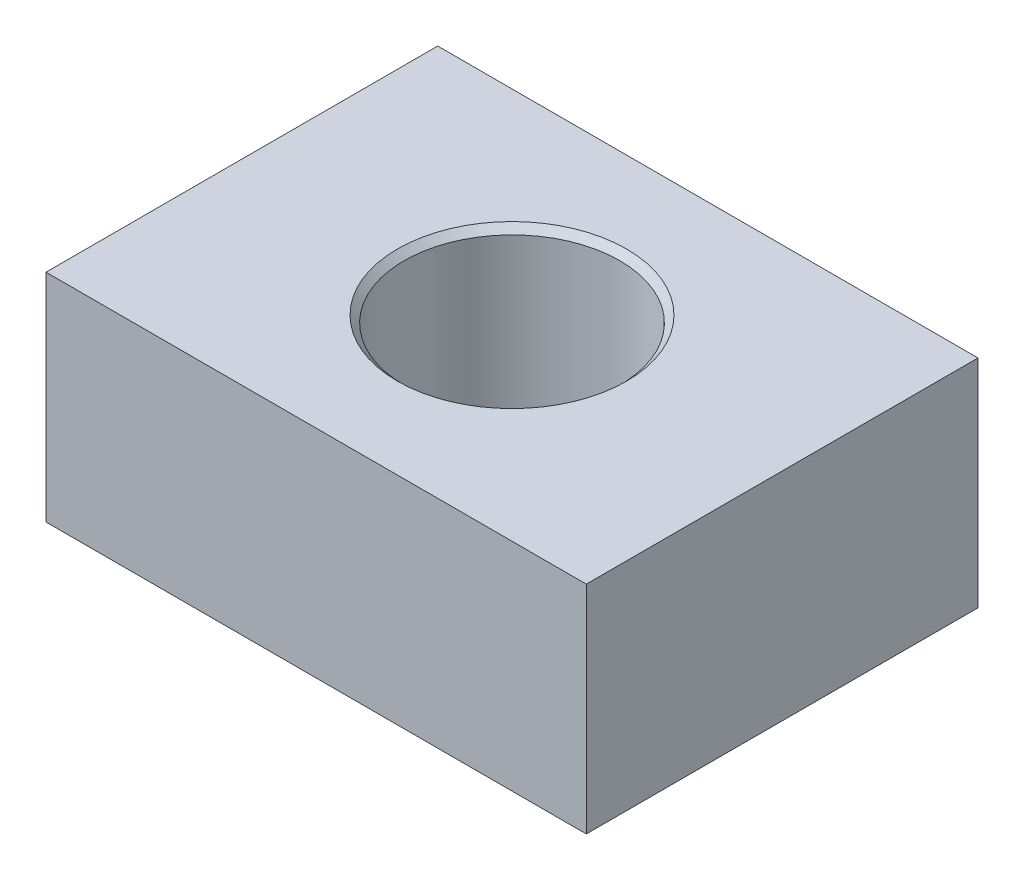
ISO-10303-21;
HEADER;
FILE_DESCRIPTION(('STEP AP214'),'2;1');
FILE_NAME('part.step','',(''),(''),'','','');
FILE_SCHEMA(('AUTOMOTIVE_DESIGN { 1 0 10303 214 1 1 1 1 }'));
ENDSEC;
DATA;
#1=APPLICATION_CONTEXT('core data for automotive mechanical design processes');
#2=APPLICATION_PROTOCOL_DEFINITION('international standard','automotive_design',2000,#1);
#3=PRODUCT_CONTEXT('',#1,'mechanical');
#4=PRODUCT('Part','Part','',(#3));
#5=PRODUCT_RELATED_PRODUCT_CATEGORY('part','',(#4));
#6=PRODUCT_DEFINITION_FORMATION('','',#4);
#7=PRODUCT_DEFINITION_CONTEXT('part definition',#1,'design');
#8=PRODUCT_DEFINITION('design','',#6,#7);
#9=PRODUCT_DEFINITION_SHAPE('','',#8);
#10=(LENGTH_UNIT() NAMED_UNIT(*) SI_UNIT(.MILLI.,.METRE.));
#11=(NAMED_UNIT(*) PLANE_ANGLE_UNIT() SI_UNIT($,.RADIAN.));
#12=(NAMED_UNIT(*) SI_UNIT($,.STERADIAN.) SOLID_ANGLE_UNIT());
#13=UNCERTAINTY_MEASURE_WITH_UNIT(LENGTH_MEASURE(1.E-05),#10,'distance_accuracy_value','');
#14=(GEOMETRIC_REPRESENTATION_CONTEXT(3) GLOBAL_UNCERTAINTY_ASSIGNED_CONTEXT((#13)) GLOBAL_UNIT_ASSIGNED_CONTEXT((#10,
#11,#12)) REPRESENTATION_CONTEXT('',''));
#15=CARTESIAN_POINT('',(0.,0.,0.));
#16=DIRECTION('',(0.,0.,1.));
#17=DIRECTION('',(1.,0.,0.));
#18=AXIS2_PLACEMENT_3D('',#15,#16,#17);
#19=CARTESIAN_POINT('',(10.,8.01,-7.25));
#20=DIRECTION('',(0.,-1.,0.));
#21=DIRECTION('',(0.,0.,-1.));
#22=AXIS2_PLACEMENT_3D('',#19,#20,#21);
#23=PLANE('',#22);
#24=CARTESIAN_POINT('',(0.,8.01,0.));
#25=DIRECTION('',(0.,-1.,0.));
#26=DIRECTION('',(0.,0.,-1.));
#27=AXIS2_PLACEMENT_3D('',#24,#25,#26);
#28=CIRCLE('',#27,4.24);
#29=CARTESIAN_POINT('',(0.,8.01,-4.24));
#30=VERTEX_POINT('',#29);
#31=EDGE_CURVE('E40',#30,#30,#28,.T.);
#32=ORIENTED_EDGE('',*,*,#31,.T.);
#33=EDGE_LOOP('',(#32));
#34=FACE_BOUND('',#33,.T.);
#35=DIRECTION('',(0.,0.,-1.));
#36=VECTOR('',#35,1.);
#37=CARTESIAN_POINT('',(10.,8.01,7.25));
#38=LINE('',#37,#36);
#39=CARTESIAN_POINT('',(10.,8.01,7.25));
#40=VERTEX_POINT('',#39);
#41=CARTESIAN_POINT('',(10.,8.01,-7.25));
#42=VERTEX_POINT('',#41);
#43=EDGE_CURVE('E83',#40,#42,#38,.T.);
#44=ORIENTED_EDGE('',*,*,#43,.T.);
#45=DIRECTION('',(-1.,0.,0.));
#46=VECTOR('',#45,1.);
#47=CARTESIAN_POINT('',(-10.,8.01,-7.25));
#48=LINE('',#47,#46);
#49=CARTESIAN_POINT('',(-10.,8.01,-7.25));
#50=VERTEX_POINT('',#49);
#51=EDGE_CURVE('E79',#42,#50,#48,.T.);
#52=ORIENTED_EDGE('',*,*,#51,.T.);
#53=DIRECTION('',(0.,0.,1.));
#54=VECTOR('',#53,1.);
#55=CARTESIAN_POINT('',(-10.,8.01,7.25));
#56=LINE('',#55,#54);
#57=CARTESIAN_POINT('',(-10.,8.01,7.25));
#58=VERTEX_POINT('',#57);
#59=EDGE_CURVE('E81',#50,#58,#56,.T.);
#60=ORIENTED_EDGE('',*,*,#59,.T.);
#61=DIRECTION('',(1.,0.,0.));
#62=VECTOR('',#61,1.);
#63=CARTESIAN_POINT('',(-10.,8.01,7.25));
#64=LINE('',#63,#62);
#65=EDGE_CURVE('E48',#58,#40,#64,.T.);
#66=ORIENTED_EDGE('',*,*,#65,.T.);
#67=EDGE_LOOP('',(#44,#52,#60,#66));
#68=FACE_BOUND('',#67,.T.);
#69=ADVANCED_FACE('F31',(#34,#68),#23,.F.);
#70=CARTESIAN_POINT('',(10.,0.,-7.25));
#71=DIRECTION('',(0.,-1.,0.));
#72=DIRECTION('',(0.,0.,-1.));
#73=AXIS2_PLACEMENT_3D('',#70,#71,#72);
#74=PLANE('',#73);
#75=CARTESIAN_POINT('',(0.,0.,0.));
#76=DIRECTION('',(0.,-1.,0.));
#77=DIRECTION('',(0.,0.,-1.));
#78=AXIS2_PLACEMENT_3D('',#75,#76,#77);
#79=CIRCLE('',#78,4.24);
#80=CARTESIAN_POINT('',(0.,0.,-4.24));
#81=VERTEX_POINT('',#80);
#82=EDGE_CURVE('E11',#81,#81,#79,.F.);
#83=ORIENTED_EDGE('',*,*,#82,.T.);
#84=EDGE_LOOP('',(#83));
#85=FACE_BOUND('',#84,.T.);
#86=DIRECTION('',(0.,0.,-1.));
#87=VECTOR('',#86,1.);
#88=CARTESIAN_POINT('',(10.,0.,7.25));
#89=LINE('',#88,#87);
#90=CARTESIAN_POINT('',(10.,0.,7.25));
#91=VERTEX_POINT('',#90);
#92=CARTESIAN_POINT('',(10.,0.,-7.25));
#93=VERTEX_POINT('',#92);
#94=EDGE_CURVE('E98',#91,#93,#89,.T.);
#95=ORIENTED_EDGE('',*,*,#94,.F.);
#96=DIRECTION('',(1.,0.,0.));
#97=VECTOR('',#96,1.);
#98=CARTESIAN_POINT('',(-10.,0.,7.25));
#99=LINE('',#98,#97);
#100=CARTESIAN_POINT('',(-10.,0.,7.25));
#101=VERTEX_POINT('',#100);
#102=EDGE_CURVE('E71',#101,#91,#99,.T.);
#103=ORIENTED_EDGE('',*,*,#102,.F.);
#104=DIRECTION('',(0.,0.,1.));
#105=VECTOR('',#104,1.);
#106=CARTESIAN_POINT('',(-10.,0.,7.25));
#107=LINE('',#106,#105);
#108=CARTESIAN_POINT('',(-10.,0.,-7.25));
#109=VERTEX_POINT('',#108);
#110=EDGE_CURVE('E65',#109,#101,#107,.T.);
#111=ORIENTED_EDGE('',*,*,#110,.F.);
#112=DIRECTION('',(-1.,0.,0.));
#113=VECTOR('',#112,1.);
#114=CARTESIAN_POINT('',(-10.,0.,-7.25));
#115=LINE('',#114,#113);
#116=EDGE_CURVE('E88',#93,#109,#115,.T.);
#117=ORIENTED_EDGE('',*,*,#116,.F.);
#118=EDGE_LOOP('',(#95,#103,#111,#117));
#119=FACE_BOUND('',#118,.T.);
#120=ADVANCED_FACE('F132',(#85,#119),#74,.T.);
#121=CARTESIAN_POINT('',(10.,8.01,7.25));
#122=DIRECTION('',(-1.,0.,0.));
#123=DIRECTION('',(0.,0.,1.));
#124=AXIS2_PLACEMENT_3D('',#121,#122,#123);
#125=PLANE('',#124);
#126=ORIENTED_EDGE('',*,*,#94,.T.);
#127=DIRECTION('',(0.,-1.,0.));
#128=VECTOR('',#127,1.);
#129=CARTESIAN_POINT('',(10.,8.01,-7.25));
#130=LINE('',#129,#128);
#131=EDGE_CURVE('E89',#42,#93,#130,.T.);
#132=ORIENTED_EDGE('',*,*,#131,.F.);
#133=ORIENTED_EDGE('',*,*,#43,.F.);
#134=DIRECTION('',(0.,-1.,0.));
#135=VECTOR('',#134,1.);
#136=CARTESIAN_POINT('',(10.,8.01,7.25));
#137=LINE('',#136,#135);
#138=EDGE_CURVE('E94',#40,#91,#137,.T.);
#139=ORIENTED_EDGE('',*,*,#138,.T.);
#140=EDGE_LOOP('',(#126,#132,#133,#139));
#141=FACE_BOUND('',#140,.T.);
#142=ADVANCED_FACE('F135',(#141),#125,.F.);
#143=CARTESIAN_POINT('',(-10.,8.01,-7.25));
#144=DIRECTION('',(0.,0.,1.));
#145=DIRECTION('',(1.,0.,0.));
#146=AXIS2_PLACEMENT_3D('',#143,#144,#145);
#147=PLANE('',#146);
#148=ORIENTED_EDGE('',*,*,#116,.T.);
#149=DIRECTION('',(0.,-1.,0.));
#150=VECTOR('',#149,1.);
#151=CARTESIAN_POINT('',(-10.,8.01,-7.25));
#152=LINE('',#151,#150);
#153=EDGE_CURVE('E86',#50,#109,#152,.T.);
#154=ORIENTED_EDGE('',*,*,#153,.F.);
#155=ORIENTED_EDGE('',*,*,#51,.F.);
#156=ORIENTED_EDGE('',*,*,#131,.T.);
#157=EDGE_LOOP('',(#148,#154,#155,#156));
#158=FACE_BOUND('',#157,.T.);
#159=ADVANCED_FACE('F87',(#158),#147,.F.);
#160=CARTESIAN_POINT('',(-10.,8.01,7.25));
#161=DIRECTION('',(1.,0.,0.));
#162=DIRECTION('',(0.,0.,-1.));
#163=AXIS2_PLACEMENT_3D('',#160,#161,#162);
#164=PLANE('',#163);
#165=ORIENTED_EDGE('',*,*,#110,.T.);
#166=DIRECTION('',(0.,-1.,0.));
#167=VECTOR('',#166,1.);
#168=CARTESIAN_POINT('',(-10.,8.01,7.25));
#169=LINE('',#168,#167);
#170=EDGE_CURVE('E90',#58,#101,#169,.T.);
#171=ORIENTED_EDGE('',*,*,#170,.F.);
#172=ORIENTED_EDGE('',*,*,#59,.F.);
#173=ORIENTED_EDGE('',*,*,#153,.T.);
#174=EDGE_LOOP('',(#165,#171,#172,#173));
#175=FACE_BOUND('',#174,.T.);
#176=ADVANCED_FACE('F92',(#175),#164,.F.);
#177=CARTESIAN_POINT('',(-10.,8.01,7.25));
#178=DIRECTION('',(0.,0.,-1.));
#179=DIRECTION('',(-1.,0.,0.));
#180=AXIS2_PLACEMENT_3D('',#177,#178,#179);
#181=PLANE('',#180);
#182=ORIENTED_EDGE('',*,*,#102,.T.);
#183=ORIENTED_EDGE('',*,*,#138,.F.);
#184=ORIENTED_EDGE('',*,*,#65,.F.);
#185=ORIENTED_EDGE('',*,*,#170,.T.);
#186=EDGE_LOOP('',(#182,#183,#184,#185));
#187=FACE_BOUND('',#186,.T.);
#188=ADVANCED_FACE('F124',(#187),#181,.F.);
#189=CARTESIAN_POINT('',(0.,8.01,0.));
#190=DIRECTION('',(0.,-1.,0.));
#191=DIRECTION('',(0.,0.,-1.));
#192=AXIS2_PLACEMENT_3D('',#189,#190,#191);
#193=CYLINDRICAL_SURFACE('',#192,3.99);
#194=CARTESIAN_POINT('',(0.,7.76,0.));
#195=DIRECTION('',(0.,-1.,0.));
#196=DIRECTION('',(0.,0.,-1.));
#197=AXIS2_PLACEMENT_3D('',#194,#195,#196);
#198=CIRCLE('',#197,3.99);
#199=CARTESIAN_POINT('',(0.,7.76,-3.99));
#200=VERTEX_POINT('',#199);
#201=EDGE_CURVE('E110',#200,#200,#198,.F.);
#202=ORIENTED_EDGE('',*,*,#201,.T.);
#203=EDGE_LOOP('',(#202));
#204=FACE_BOUND('',#203,.T.);
#205=CARTESIAN_POINT('',(0.,0.25,0.));
#206=DIRECTION('',(0.,-1.,0.));
#207=DIRECTION('',(0.,0.,-1.));
#208=AXIS2_PLACEMENT_3D('',#205,#206,#207);
#209=CIRCLE('',#208,3.99);
#210=CARTESIAN_POINT('',(0.,0.25,-3.99));
#211=VERTEX_POINT('',#210);
#212=EDGE_CURVE('E107',#211,#211,#209,.T.);
#213=ORIENTED_EDGE('',*,*,#212,.T.);
#214=EDGE_LOOP('',(#213));
#215=FACE_BOUND('',#214,.T.);
#216=ADVANCED_FACE('F119',(#204,#215),#193,.F.);
#217=CARTESIAN_POINT('',(0.,7.76,0.));
#218=DIRECTION('',(0.,1.,0.));
#219=DIRECTION('',(0.,0.,1.));
#220=AXIS2_PLACEMENT_3D('',#217,#218,#219);
#221=CONICAL_SURFACE('',#220,3.99,0.785398163397448);
#222=ORIENTED_EDGE('',*,*,#31,.F.);
#223=EDGE_LOOP('',(#222));
#224=FACE_BOUND('',#223,.T.);
#225=ORIENTED_EDGE('',*,*,#201,.F.);
#226=EDGE_LOOP('',(#225));
#227=FACE_BOUND('',#226,.T.);
#228=ADVANCED_FACE('F116',(#224,#227),#221,.F.);
#229=CARTESIAN_POINT('',(0.,0.,0.));
#230=DIRECTION('',(0.,-1.,0.));
#231=DIRECTION('',(0.,0.,-1.));
#232=AXIS2_PLACEMENT_3D('',#229,#230,#231);
#233=CONICAL_SURFACE('',#232,4.24,0.785398163397452);
#234=ORIENTED_EDGE('',*,*,#212,.F.);
#235=EDGE_LOOP('',(#234));
#236=FACE_BOUND('',#235,.T.);
#237=ORIENTED_EDGE('',*,*,#82,.F.);
#238=EDGE_LOOP('',(#237));
#239=FACE_BOUND('',#238,.T.);
#240=ADVANCED_FACE('F33',(#236,#239),#233,.F.);
#241=CLOSED_SHELL('',(#69,#120,#142,#159,#176,#188,#216,#228,#240));
#242=MANIFOLD_SOLID_BREP('B2',#241);
#243=ADVANCED_BREP_SHAPE_REPRESENTATION('',(#18,#242),#14);
#244=SHAPE_DEFINITION_REPRESENTATION(#9,#243);
ENDSEC;
END-ISO-10303-21;
